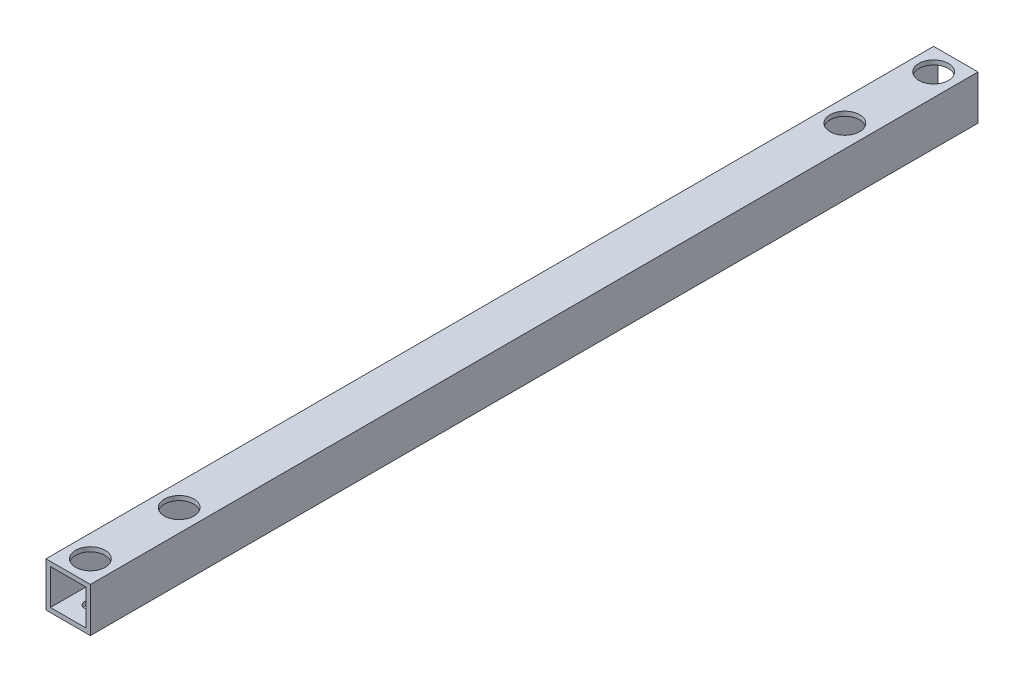
ISO-10303-21;
HEADER;
FILE_DESCRIPTION(('STEP AP214'),'2;1');
FILE_NAME('part.step','',(''),(''),'','','');
FILE_SCHEMA(('AUTOMOTIVE_DESIGN { 1 0 10303 214 1 1 1 1 }'));
ENDSEC;
DATA;
#1=APPLICATION_CONTEXT('core data for automotive mechanical design processes');
#2=APPLICATION_PROTOCOL_DEFINITION('international standard','automotive_design',2000,#1);
#3=PRODUCT_CONTEXT('',#1,'mechanical');
#4=PRODUCT('Part','Part','',(#3));
#5=PRODUCT_RELATED_PRODUCT_CATEGORY('part','',(#4));
#6=PRODUCT_DEFINITION_FORMATION('','',#4);
#7=PRODUCT_DEFINITION_CONTEXT('part definition',#1,'design');
#8=PRODUCT_DEFINITION('design','',#6,#7);
#9=PRODUCT_DEFINITION_SHAPE('','',#8);
#10=(LENGTH_UNIT() NAMED_UNIT(*) SI_UNIT(.MILLI.,.METRE.));
#11=(NAMED_UNIT(*) PLANE_ANGLE_UNIT() SI_UNIT($,.RADIAN.));
#12=(NAMED_UNIT(*) SI_UNIT($,.STERADIAN.) SOLID_ANGLE_UNIT());
#13=UNCERTAINTY_MEASURE_WITH_UNIT(LENGTH_MEASURE(1.E-05),#10,'distance_accuracy_value','');
#14=(GEOMETRIC_REPRESENTATION_CONTEXT(3) GLOBAL_UNCERTAINTY_ASSIGNED_CONTEXT((#13)) GLOBAL_UNIT_ASSIGNED_CONTEXT((#10,
#11,#12)) REPRESENTATION_CONTEXT('',''));
#15=CARTESIAN_POINT('',(0.,0.,0.));
#16=DIRECTION('',(0.,0.,1.));
#17=DIRECTION('',(1.,0.,0.));
#18=AXIS2_PLACEMENT_3D('',#15,#16,#17);
#19=CARTESIAN_POINT('',(0.,0.,300.));
#20=DIRECTION('',(0.,0.,-1.));
#21=DIRECTION('',(-1.,0.,0.));
#22=AXIS2_PLACEMENT_3D('',#19,#20,#21);
#23=PLANE('',#22);
#24=DIRECTION('',(0.,1.,0.));
#25=VECTOR('',#24,1.);
#26=CARTESIAN_POINT('',(7.5,-7.5,300.));
#27=LINE('',#26,#25);
#28=CARTESIAN_POINT('',(7.5,-7.5,300.));
#29=VERTEX_POINT('',#28);
#30=CARTESIAN_POINT('',(7.5,7.5,300.));
#31=VERTEX_POINT('',#30);
#32=EDGE_CURVE('E144',#29,#31,#27,.T.);
#33=ORIENTED_EDGE('',*,*,#32,.T.);
#34=DIRECTION('',(-1.,0.,0.));
#35=VECTOR('',#34,1.);
#36=CARTESIAN_POINT('',(-7.5,7.5,300.));
#37=LINE('',#36,#35);
#38=CARTESIAN_POINT('',(-7.5,7.5,300.));
#39=VERTEX_POINT('',#38);
#40=EDGE_CURVE('E147',#31,#39,#37,.T.);
#41=ORIENTED_EDGE('',*,*,#40,.T.);
#42=DIRECTION('',(0.,-1.,0.));
#43=VECTOR('',#42,1.);
#44=CARTESIAN_POINT('',(-7.5,-7.5,300.));
#45=LINE('',#44,#43);
#46=CARTESIAN_POINT('',(-7.5,-7.5,300.));
#47=VERTEX_POINT('',#46);
#48=EDGE_CURVE('E150',#39,#47,#45,.T.);
#49=ORIENTED_EDGE('',*,*,#48,.T.);
#50=DIRECTION('',(1.,0.,0.));
#51=VECTOR('',#50,1.);
#52=CARTESIAN_POINT('',(-7.5,-7.5,300.));
#53=LINE('',#52,#51);
#54=EDGE_CURVE('E152',#47,#29,#53,.T.);
#55=ORIENTED_EDGE('',*,*,#54,.T.);
#56=EDGE_LOOP('',(#33,#41,#49,#55));
#57=FACE_BOUND('',#56,.T.);
#58=DIRECTION('',(0.,1.,0.));
#59=VECTOR('',#58,1.);
#60=CARTESIAN_POINT('',(6.,-6.,300.));
#61=LINE('',#60,#59);
#62=CARTESIAN_POINT('',(6.,-6.,300.));
#63=VERTEX_POINT('',#62);
#64=CARTESIAN_POINT('',(6.,6.,300.));
#65=VERTEX_POINT('',#64);
#66=EDGE_CURVE('E106',#63,#65,#61,.T.);
#67=ORIENTED_EDGE('',*,*,#66,.F.);
#68=DIRECTION('',(1.,0.,0.));
#69=VECTOR('',#68,1.);
#70=CARTESIAN_POINT('',(-6.,-6.,300.));
#71=LINE('',#70,#69);
#72=CARTESIAN_POINT('',(-6.,-6.,300.));
#73=VERTEX_POINT('',#72);
#74=EDGE_CURVE('E128',#73,#63,#71,.T.);
#75=ORIENTED_EDGE('',*,*,#74,.F.);
#76=DIRECTION('',(0.,-1.,0.));
#77=VECTOR('',#76,1.);
#78=CARTESIAN_POINT('',(-6.,-6.,300.));
#79=LINE('',#78,#77);
#80=CARTESIAN_POINT('',(-6.,6.,300.));
#81=VERTEX_POINT('',#80);
#82=EDGE_CURVE('E126',#81,#73,#79,.T.);
#83=ORIENTED_EDGE('',*,*,#82,.F.);
#84=DIRECTION('',(-1.,0.,0.));
#85=VECTOR('',#84,1.);
#86=CARTESIAN_POINT('',(-6.,6.,300.));
#87=LINE('',#86,#85);
#88=EDGE_CURVE('E114',#65,#81,#87,.T.);
#89=ORIENTED_EDGE('',*,*,#88,.F.);
#90=EDGE_LOOP('',(#67,#75,#83,#89));
#91=FACE_BOUND('',#90,.T.);
#92=ADVANCED_FACE('F39',(#57,#91),#23,.F.);
#93=CARTESIAN_POINT('',(0.,0.,0.));
#94=DIRECTION('',(0.,0.,-1.));
#95=DIRECTION('',(-1.,0.,0.));
#96=AXIS2_PLACEMENT_3D('',#93,#94,#95);
#97=PLANE('',#96);
#98=DIRECTION('',(0.,1.,0.));
#99=VECTOR('',#98,1.);
#100=CARTESIAN_POINT('',(7.5,-7.5,0.));
#101=LINE('',#100,#99);
#102=CARTESIAN_POINT('',(7.5,-7.5,0.));
#103=VERTEX_POINT('',#102);
#104=CARTESIAN_POINT('',(7.5,7.5,0.));
#105=VERTEX_POINT('',#104);
#106=EDGE_CURVE('E122',#103,#105,#101,.T.);
#107=ORIENTED_EDGE('',*,*,#106,.F.);
#108=DIRECTION('',(1.,0.,0.));
#109=VECTOR('',#108,1.);
#110=CARTESIAN_POINT('',(-7.5,-7.5,0.));
#111=LINE('',#110,#109);
#112=CARTESIAN_POINT('',(-7.5,-7.5,0.));
#113=VERTEX_POINT('',#112);
#114=EDGE_CURVE('E148',#113,#103,#111,.T.);
#115=ORIENTED_EDGE('',*,*,#114,.F.);
#116=DIRECTION('',(0.,-1.,0.));
#117=VECTOR('',#116,1.);
#118=CARTESIAN_POINT('',(-7.5,-7.5,0.));
#119=LINE('',#118,#117);
#120=CARTESIAN_POINT('',(-7.5,7.5,0.));
#121=VERTEX_POINT('',#120);
#122=EDGE_CURVE('E159',#121,#113,#119,.T.);
#123=ORIENTED_EDGE('',*,*,#122,.F.);
#124=DIRECTION('',(-1.,0.,0.));
#125=VECTOR('',#124,1.);
#126=CARTESIAN_POINT('',(-7.5,7.5,0.));
#127=LINE('',#126,#125);
#128=EDGE_CURVE('E157',#105,#121,#127,.T.);
#129=ORIENTED_EDGE('',*,*,#128,.F.);
#130=EDGE_LOOP('',(#107,#115,#123,#129));
#131=FACE_BOUND('',#130,.T.);
#132=DIRECTION('',(1.,0.,0.));
#133=VECTOR('',#132,1.);
#134=CARTESIAN_POINT('',(-6.,-6.,0.));
#135=LINE('',#134,#133);
#136=CARTESIAN_POINT('',(-6.,-6.,0.));
#137=VERTEX_POINT('',#136);
#138=CARTESIAN_POINT('',(6.,-6.,0.));
#139=VERTEX_POINT('',#138);
#140=EDGE_CURVE('E115',#137,#139,#135,.T.);
#141=ORIENTED_EDGE('',*,*,#140,.T.);
#142=DIRECTION('',(0.,1.,0.));
#143=VECTOR('',#142,1.);
#144=CARTESIAN_POINT('',(6.,-6.,0.));
#145=LINE('',#144,#143);
#146=CARTESIAN_POINT('',(6.,6.,0.));
#147=VERTEX_POINT('',#146);
#148=EDGE_CURVE('E64',#139,#147,#145,.T.);
#149=ORIENTED_EDGE('',*,*,#148,.T.);
#150=DIRECTION('',(-1.,0.,0.));
#151=VECTOR('',#150,1.);
#152=CARTESIAN_POINT('',(-6.,6.,0.));
#153=LINE('',#152,#151);
#154=CARTESIAN_POINT('',(-6.,6.,0.));
#155=VERTEX_POINT('',#154);
#156=EDGE_CURVE('E121',#147,#155,#153,.T.);
#157=ORIENTED_EDGE('',*,*,#156,.T.);
#158=DIRECTION('',(0.,-1.,0.));
#159=VECTOR('',#158,1.);
#160=CARTESIAN_POINT('',(-6.,-6.,0.));
#161=LINE('',#160,#159);
#162=EDGE_CURVE('E136',#155,#137,#161,.T.);
#163=ORIENTED_EDGE('',*,*,#162,.T.);
#164=EDGE_LOOP('',(#141,#149,#157,#163));
#165=FACE_BOUND('',#164,.T.);
#166=ADVANCED_FACE('F229',(#131,#165),#97,.T.);
#167=CARTESIAN_POINT('',(7.5,-7.5,300.));
#168=DIRECTION('',(-1.,0.,0.));
#169=DIRECTION('',(0.,0.,1.));
#170=AXIS2_PLACEMENT_3D('',#167,#168,#169);
#171=PLANE('',#170);
#172=ORIENTED_EDGE('',*,*,#106,.T.);
#173=DIRECTION('',(0.,0.,-1.));
#174=VECTOR('',#173,1.);
#175=CARTESIAN_POINT('',(7.5,7.5,300.));
#176=LINE('',#175,#174);
#177=EDGE_CURVE('E11',#31,#105,#176,.T.);
#178=ORIENTED_EDGE('',*,*,#177,.F.);
#179=ORIENTED_EDGE('',*,*,#32,.F.);
#180=DIRECTION('',(0.,0.,-1.));
#181=VECTOR('',#180,1.);
#182=CARTESIAN_POINT('',(7.5,-7.5,300.));
#183=LINE('',#182,#181);
#184=EDGE_CURVE('E154',#29,#103,#183,.T.);
#185=ORIENTED_EDGE('',*,*,#184,.T.);
#186=EDGE_LOOP('',(#172,#178,#179,#185));
#187=FACE_BOUND('',#186,.T.);
#188=ADVANCED_FACE('F41',(#187),#171,.F.);
#189=CARTESIAN_POINT('',(-7.5,7.5,300.));
#190=DIRECTION('',(0.,-1.,0.));
#191=DIRECTION('',(0.,0.,-1.));
#192=AXIS2_PLACEMENT_3D('',#189,#190,#191);
#193=PLANE('',#192);
#194=CARTESIAN_POINT('',(-8.50054585898909E-13,7.5,292.5));
#195=DIRECTION('',(0.,1.,0.));
#196=DIRECTION('',(0.,0.,1.));
#197=AXIS2_PLACEMENT_3D('',#194,#195,#196);
#198=CIRCLE('',#197,5.);
#199=CARTESIAN_POINT('',(-8.50054585898909E-13,7.5,297.5));
#200=VERTEX_POINT('',#199);
#201=EDGE_CURVE('E185',#200,#200,#198,.T.);
#202=ORIENTED_EDGE('',*,*,#201,.F.);
#203=EDGE_LOOP('',(#202));
#204=FACE_BOUND('',#203,.T.);
#205=CARTESIAN_POINT('',(-8.74713494715871E-13,7.5,262.5));
#206=DIRECTION('',(0.,1.,0.));
#207=DIRECTION('',(0.,0.,1.));
#208=AXIS2_PLACEMENT_3D('',#205,#206,#207);
#209=CIRCLE('',#208,5.);
#210=CARTESIAN_POINT('',(-8.74713494715871E-13,7.5,267.5));
#211=VERTEX_POINT('',#210);
#212=EDGE_CURVE('E297',#211,#211,#209,.T.);
#213=ORIENTED_EDGE('',*,*,#212,.F.);
#214=EDGE_LOOP('',(#213));
#215=FACE_BOUND('',#214,.T.);
#216=CARTESIAN_POINT('',(0.,7.5,37.5));
#217=DIRECTION('',(0.,1.,0.));
#218=DIRECTION('',(0.,0.,1.));
#219=AXIS2_PLACEMENT_3D('',#216,#217,#218);
#220=CIRCLE('',#219,5.);
#221=CARTESIAN_POINT('',(0.,7.5,42.5));
#222=VERTEX_POINT('',#221);
#223=EDGE_CURVE('E300',#222,#222,#220,.T.);
#224=ORIENTED_EDGE('',*,*,#223,.F.);
#225=EDGE_LOOP('',(#224));
#226=FACE_BOUND('',#225,.T.);
#227=CARTESIAN_POINT('',(0.,7.5,7.5));
#228=DIRECTION('',(0.,1.,0.));
#229=DIRECTION('',(0.,0.,1.));
#230=AXIS2_PLACEMENT_3D('',#227,#228,#229);
#231=CIRCLE('',#230,5.);
#232=CARTESIAN_POINT('',(0.,7.5,12.5));
#233=VERTEX_POINT('',#232);
#234=EDGE_CURVE('E205',#233,#233,#231,.T.);
#235=ORIENTED_EDGE('',*,*,#234,.F.);
#236=EDGE_LOOP('',(#235));
#237=FACE_BOUND('',#236,.T.);
#238=ORIENTED_EDGE('',*,*,#128,.T.);
#239=DIRECTION('',(0.,0.,-1.));
#240=VECTOR('',#239,1.);
#241=CARTESIAN_POINT('',(-7.5,7.5,300.));
#242=LINE('',#241,#240);
#243=EDGE_CURVE('E48',#39,#121,#242,.T.);
#244=ORIENTED_EDGE('',*,*,#243,.F.);
#245=ORIENTED_EDGE('',*,*,#40,.F.);
#246=ORIENTED_EDGE('',*,*,#177,.T.);
#247=EDGE_LOOP('',(#238,#244,#245,#246));
#248=FACE_BOUND('',#247,.T.);
#249=ADVANCED_FACE('F233',(#204,#215,#226,#237,#248),#193,.F.);
#250=CARTESIAN_POINT('',(-7.5,-7.5,300.));
#251=DIRECTION('',(1.,0.,0.));
#252=DIRECTION('',(0.,0.,-1.));
#253=AXIS2_PLACEMENT_3D('',#250,#251,#252);
#254=PLANE('',#253);
#255=ORIENTED_EDGE('',*,*,#122,.T.);
#256=DIRECTION('',(0.,0.,-1.));
#257=VECTOR('',#256,1.);
#258=CARTESIAN_POINT('',(-7.5,-7.5,300.));
#259=LINE('',#258,#257);
#260=EDGE_CURVE('E164',#47,#113,#259,.T.);
#261=ORIENTED_EDGE('',*,*,#260,.F.);
#262=ORIENTED_EDGE('',*,*,#48,.F.);
#263=ORIENTED_EDGE('',*,*,#243,.T.);
#264=EDGE_LOOP('',(#255,#261,#262,#263));
#265=FACE_BOUND('',#264,.T.);
#266=ADVANCED_FACE('F216',(#265),#254,.F.);
#267=CARTESIAN_POINT('',(-7.5,-7.5,300.));
#268=DIRECTION('',(0.,1.,0.));
#269=DIRECTION('',(0.,0.,1.));
#270=AXIS2_PLACEMENT_3D('',#267,#268,#269);
#271=PLANE('',#270);
#272=CARTESIAN_POINT('',(0.,-7.5,7.5));
#273=DIRECTION('',(0.,-1.,0.));
#274=DIRECTION('',(0.,0.,-1.));
#275=AXIS2_PLACEMENT_3D('',#272,#273,#274);
#276=CIRCLE('',#275,2.);
#277=CARTESIAN_POINT('',(0.,-7.5,5.5));
#278=VERTEX_POINT('',#277);
#279=EDGE_CURVE('E201',#278,#278,#276,.T.);
#280=ORIENTED_EDGE('',*,*,#279,.F.);
#281=EDGE_LOOP('',(#280));
#282=FACE_BOUND('',#281,.T.);
#283=CARTESIAN_POINT('',(-8.50054585898909E-13,-7.5,292.5));
#284=DIRECTION('',(0.,-1.,0.));
#285=DIRECTION('',(0.,0.,-1.));
#286=AXIS2_PLACEMENT_3D('',#283,#284,#285);
#287=CIRCLE('',#286,2.);
#288=CARTESIAN_POINT('',(-8.50054585898909E-13,-7.5,290.5));
#289=VERTEX_POINT('',#288);
#290=EDGE_CURVE('E196',#289,#289,#287,.T.);
#291=ORIENTED_EDGE('',*,*,#290,.F.);
#292=EDGE_LOOP('',(#291));
#293=FACE_BOUND('',#292,.T.);
#294=CARTESIAN_POINT('',(-8.74713494715871E-13,-7.5,262.5));
#295=DIRECTION('',(0.,-1.,0.));
#296=DIRECTION('',(0.,0.,-1.));
#297=AXIS2_PLACEMENT_3D('',#294,#295,#296);
#298=CIRCLE('',#297,2.);
#299=CARTESIAN_POINT('',(-8.74713494715871E-13,-7.5,260.5));
#300=VERTEX_POINT('',#299);
#301=EDGE_CURVE('E192',#300,#300,#298,.T.);
#302=ORIENTED_EDGE('',*,*,#301,.F.);
#303=EDGE_LOOP('',(#302));
#304=FACE_BOUND('',#303,.T.);
#305=CARTESIAN_POINT('',(0.,-7.5,37.5));
#306=DIRECTION('',(0.,-1.,0.));
#307=DIRECTION('',(0.,0.,-1.));
#308=AXIS2_PLACEMENT_3D('',#305,#306,#307);
#309=CIRCLE('',#308,2.);
#310=CARTESIAN_POINT('',(0.,-7.5,35.5));
#311=VERTEX_POINT('',#310);
#312=EDGE_CURVE('E173',#311,#311,#309,.T.);
#313=ORIENTED_EDGE('',*,*,#312,.F.);
#314=EDGE_LOOP('',(#313));
#315=FACE_BOUND('',#314,.T.);
#316=ORIENTED_EDGE('',*,*,#114,.T.);
#317=ORIENTED_EDGE('',*,*,#184,.F.);
#318=ORIENTED_EDGE('',*,*,#54,.F.);
#319=ORIENTED_EDGE('',*,*,#260,.T.);
#320=EDGE_LOOP('',(#316,#317,#318,#319));
#321=FACE_BOUND('',#320,.T.);
#322=ADVANCED_FACE('F213',(#282,#293,#304,#315,#321),#271,.F.);
#323=CARTESIAN_POINT('',(6.,-6.,300.));
#324=DIRECTION('',(-1.,0.,0.));
#325=DIRECTION('',(0.,0.,1.));
#326=AXIS2_PLACEMENT_3D('',#323,#324,#325);
#327=PLANE('',#326);
#328=ORIENTED_EDGE('',*,*,#148,.F.);
#329=DIRECTION('',(0.,0.,-1.));
#330=VECTOR('',#329,1.);
#331=CARTESIAN_POINT('',(6.,-6.,300.));
#332=LINE('',#331,#330);
#333=EDGE_CURVE('E110',#63,#139,#332,.T.);
#334=ORIENTED_EDGE('',*,*,#333,.F.);
#335=ORIENTED_EDGE('',*,*,#66,.T.);
#336=DIRECTION('',(0.,0.,-1.));
#337=VECTOR('',#336,1.);
#338=CARTESIAN_POINT('',(6.,6.,300.));
#339=LINE('',#338,#337);
#340=EDGE_CURVE('E109',#65,#147,#339,.T.);
#341=ORIENTED_EDGE('',*,*,#340,.T.);
#342=EDGE_LOOP('',(#328,#334,#335,#341));
#343=FACE_BOUND('',#342,.T.);
#344=ADVANCED_FACE('F108',(#343),#327,.T.);
#345=CARTESIAN_POINT('',(-6.,6.,300.));
#346=DIRECTION('',(0.,-1.,0.));
#347=DIRECTION('',(0.,0.,-1.));
#348=AXIS2_PLACEMENT_3D('',#345,#346,#347);
#349=PLANE('',#348);
#350=CARTESIAN_POINT('',(-8.50054585898909E-13,6.,292.5));
#351=DIRECTION('',(0.,-1.,0.));
#352=DIRECTION('',(0.,0.,-1.));
#353=AXIS2_PLACEMENT_3D('',#350,#351,#352);
#354=CIRCLE('',#353,5.);
#355=CARTESIAN_POINT('',(-8.50054585898909E-13,6.,287.5));
#356=VERTEX_POINT('',#355);
#357=EDGE_CURVE('E43',#356,#356,#354,.T.);
#358=ORIENTED_EDGE('',*,*,#357,.F.);
#359=EDGE_LOOP('',(#358));
#360=FACE_BOUND('',#359,.T.);
#361=CARTESIAN_POINT('',(-8.74713494715871E-13,6.,262.5));
#362=DIRECTION('',(0.,-1.,0.));
#363=DIRECTION('',(0.,0.,-1.));
#364=AXIS2_PLACEMENT_3D('',#361,#362,#363);
#365=CIRCLE('',#364,5.);
#366=CARTESIAN_POINT('',(-8.74713494715871E-13,6.,257.5));
#367=VERTEX_POINT('',#366);
#368=EDGE_CURVE('E187',#367,#367,#365,.T.);
#369=ORIENTED_EDGE('',*,*,#368,.F.);
#370=EDGE_LOOP('',(#369));
#371=FACE_BOUND('',#370,.T.);
#372=CARTESIAN_POINT('',(0.,6.,37.5));
#373=DIRECTION('',(0.,-1.,0.));
#374=DIRECTION('',(0.,0.,-1.));
#375=AXIS2_PLACEMENT_3D('',#372,#373,#374);
#376=CIRCLE('',#375,5.);
#377=CARTESIAN_POINT('',(0.,6.,32.5));
#378=VERTEX_POINT('',#377);
#379=EDGE_CURVE('E184',#378,#378,#376,.T.);
#380=ORIENTED_EDGE('',*,*,#379,.F.);
#381=EDGE_LOOP('',(#380));
#382=FACE_BOUND('',#381,.T.);
#383=CARTESIAN_POINT('',(0.,6.,7.5));
#384=DIRECTION('',(0.,-1.,0.));
#385=DIRECTION('',(0.,0.,-1.));
#386=AXIS2_PLACEMENT_3D('',#383,#384,#385);
#387=CIRCLE('',#386,5.);
#388=CARTESIAN_POINT('',(0.,6.,2.5));
#389=VERTEX_POINT('',#388);
#390=EDGE_CURVE('E181',#389,#389,#387,.T.);
#391=ORIENTED_EDGE('',*,*,#390,.F.);
#392=EDGE_LOOP('',(#391));
#393=FACE_BOUND('',#392,.T.);
#394=ORIENTED_EDGE('',*,*,#156,.F.);
#395=ORIENTED_EDGE('',*,*,#340,.F.);
#396=ORIENTED_EDGE('',*,*,#88,.T.);
#397=DIRECTION('',(0.,0.,-1.));
#398=VECTOR('',#397,1.);
#399=CARTESIAN_POINT('',(-6.,6.,300.));
#400=LINE('',#399,#398);
#401=EDGE_CURVE('E123',#81,#155,#400,.T.);
#402=ORIENTED_EDGE('',*,*,#401,.T.);
#403=EDGE_LOOP('',(#394,#395,#396,#402));
#404=FACE_BOUND('',#403,.T.);
#405=ADVANCED_FACE('F118',(#360,#371,#382,#393,#404),#349,.T.);
#406=CARTESIAN_POINT('',(-6.,-6.,300.));
#407=DIRECTION('',(1.,0.,0.));
#408=DIRECTION('',(0.,0.,-1.));
#409=AXIS2_PLACEMENT_3D('',#406,#407,#408);
#410=PLANE('',#409);
#411=ORIENTED_EDGE('',*,*,#162,.F.);
#412=ORIENTED_EDGE('',*,*,#401,.F.);
#413=ORIENTED_EDGE('',*,*,#82,.T.);
#414=DIRECTION('',(0.,0.,-1.));
#415=VECTOR('',#414,1.);
#416=CARTESIAN_POINT('',(-6.,-6.,300.));
#417=LINE('',#416,#415);
#418=EDGE_CURVE('E56',#73,#137,#417,.T.);
#419=ORIENTED_EDGE('',*,*,#418,.T.);
#420=EDGE_LOOP('',(#411,#412,#413,#419));
#421=FACE_BOUND('',#420,.T.);
#422=ADVANCED_FACE('F255',(#421),#410,.T.);
#423=CARTESIAN_POINT('',(-6.,-6.,300.));
#424=DIRECTION('',(0.,1.,0.));
#425=DIRECTION('',(0.,0.,1.));
#426=AXIS2_PLACEMENT_3D('',#423,#424,#425);
#427=PLANE('',#426);
#428=CARTESIAN_POINT('',(0.,-6.,7.5));
#429=DIRECTION('',(0.,1.,0.));
#430=DIRECTION('',(0.,0.,1.));
#431=AXIS2_PLACEMENT_3D('',#428,#429,#430);
#432=CIRCLE('',#431,2.);
#433=CARTESIAN_POINT('',(0.,-6.,9.5));
#434=VERTEX_POINT('',#433);
#435=EDGE_CURVE('E134',#434,#434,#432,.T.);
#436=ORIENTED_EDGE('',*,*,#435,.F.);
#437=EDGE_LOOP('',(#436));
#438=FACE_BOUND('',#437,.T.);
#439=CARTESIAN_POINT('',(-8.50054585898909E-13,-6.,292.5));
#440=DIRECTION('',(0.,1.,0.));
#441=DIRECTION('',(0.,0.,1.));
#442=AXIS2_PLACEMENT_3D('',#439,#440,#441);
#443=CIRCLE('',#442,2.);
#444=CARTESIAN_POINT('',(-8.50054585898909E-13,-6.,294.5));
#445=VERTEX_POINT('',#444);
#446=EDGE_CURVE('E176',#445,#445,#443,.T.);
#447=ORIENTED_EDGE('',*,*,#446,.F.);
#448=EDGE_LOOP('',(#447));
#449=FACE_BOUND('',#448,.T.);
#450=CARTESIAN_POINT('',(-8.74713494715871E-13,-6.,262.5));
#451=DIRECTION('',(0.,1.,0.));
#452=DIRECTION('',(0.,0.,1.));
#453=AXIS2_PLACEMENT_3D('',#450,#451,#452);
#454=CIRCLE('',#453,2.);
#455=CARTESIAN_POINT('',(-8.74713494715871E-13,-6.,264.5));
#456=VERTEX_POINT('',#455);
#457=EDGE_CURVE('E172',#456,#456,#454,.T.);
#458=ORIENTED_EDGE('',*,*,#457,.F.);
#459=EDGE_LOOP('',(#458));
#460=FACE_BOUND('',#459,.T.);
#461=CARTESIAN_POINT('',(0.,-6.,37.5));
#462=DIRECTION('',(0.,1.,0.));
#463=DIRECTION('',(0.,0.,1.));
#464=AXIS2_PLACEMENT_3D('',#461,#462,#463);
#465=CIRCLE('',#464,2.);
#466=CARTESIAN_POINT('',(0.,-6.,39.5));
#467=VERTEX_POINT('',#466);
#468=EDGE_CURVE('E169',#467,#467,#465,.T.);
#469=ORIENTED_EDGE('',*,*,#468,.F.);
#470=EDGE_LOOP('',(#469));
#471=FACE_BOUND('',#470,.T.);
#472=ORIENTED_EDGE('',*,*,#140,.F.);
#473=ORIENTED_EDGE('',*,*,#418,.F.);
#474=ORIENTED_EDGE('',*,*,#74,.T.);
#475=ORIENTED_EDGE('',*,*,#333,.T.);
#476=EDGE_LOOP('',(#472,#473,#474,#475));
#477=FACE_BOUND('',#476,.T.);
#478=ADVANCED_FACE('F259',(#438,#449,#460,#471,#477),#427,.T.);
#479=CARTESIAN_POINT('',(0.,12.5,37.5));
#480=DIRECTION('',(0.,-1.,0.));
#481=DIRECTION('',(0.,0.,-1.));
#482=AXIS2_PLACEMENT_3D('',#479,#480,#481);
#483=CYLINDRICAL_SURFACE('',#482,2.);
#484=ORIENTED_EDGE('',*,*,#468,.T.);
#485=EDGE_LOOP('',(#484));
#486=FACE_BOUND('',#485,.T.);
#487=ORIENTED_EDGE('',*,*,#312,.T.);
#488=EDGE_LOOP('',(#487));
#489=FACE_BOUND('',#488,.T.);
#490=ADVANCED_FACE('F211',(#486,#489),#483,.F.);
#491=CARTESIAN_POINT('',(-8.74713494715871E-13,12.5,262.5));
#492=DIRECTION('',(0.,-1.,0.));
#493=DIRECTION('',(0.,0.,-1.));
#494=AXIS2_PLACEMENT_3D('',#491,#492,#493);
#495=CYLINDRICAL_SURFACE('',#494,2.);
#496=ORIENTED_EDGE('',*,*,#457,.T.);
#497=EDGE_LOOP('',(#496));
#498=FACE_BOUND('',#497,.T.);
#499=ORIENTED_EDGE('',*,*,#301,.T.);
#500=EDGE_LOOP('',(#499));
#501=FACE_BOUND('',#500,.T.);
#502=ADVANCED_FACE('F266',(#498,#501),#495,.F.);
#503=CARTESIAN_POINT('',(-8.50054585898909E-13,12.5,292.5));
#504=DIRECTION('',(0.,-1.,0.));
#505=DIRECTION('',(0.,0.,-1.));
#506=AXIS2_PLACEMENT_3D('',#503,#504,#505);
#507=CYLINDRICAL_SURFACE('',#506,2.);
#508=ORIENTED_EDGE('',*,*,#446,.T.);
#509=EDGE_LOOP('',(#508));
#510=FACE_BOUND('',#509,.T.);
#511=ORIENTED_EDGE('',*,*,#290,.T.);
#512=EDGE_LOOP('',(#511));
#513=FACE_BOUND('',#512,.T.);
#514=ADVANCED_FACE('F268',(#510,#513),#507,.F.);
#515=CARTESIAN_POINT('',(0.,12.5,7.5));
#516=DIRECTION('',(0.,-1.,0.));
#517=DIRECTION('',(0.,0.,-1.));
#518=AXIS2_PLACEMENT_3D('',#515,#516,#517);
#519=CYLINDRICAL_SURFACE('',#518,2.);
#520=ORIENTED_EDGE('',*,*,#435,.T.);
#521=EDGE_LOOP('',(#520));
#522=FACE_BOUND('',#521,.T.);
#523=ORIENTED_EDGE('',*,*,#279,.T.);
#524=EDGE_LOOP('',(#523));
#525=FACE_BOUND('',#524,.T.);
#526=ADVANCED_FACE('F271',(#522,#525),#519,.F.);
#527=CARTESIAN_POINT('',(0.,-2.5,7.5));
#528=DIRECTION('',(0.,1.,0.));
#529=DIRECTION('',(0.,0.,1.));
#530=AXIS2_PLACEMENT_3D('',#527,#528,#529);
#531=CYLINDRICAL_SURFACE('',#530,5.);
#532=ORIENTED_EDGE('',*,*,#390,.T.);
#533=EDGE_LOOP('',(#532));
#534=FACE_BOUND('',#533,.T.);
#535=ORIENTED_EDGE('',*,*,#234,.T.);
#536=EDGE_LOOP('',(#535));
#537=FACE_BOUND('',#536,.T.);
#538=ADVANCED_FACE('F275',(#534,#537),#531,.F.);
#539=CARTESIAN_POINT('',(0.,-2.5,37.5));
#540=DIRECTION('',(0.,1.,0.));
#541=DIRECTION('',(0.,0.,1.));
#542=AXIS2_PLACEMENT_3D('',#539,#540,#541);
#543=CYLINDRICAL_SURFACE('',#542,5.);
#544=ORIENTED_EDGE('',*,*,#379,.T.);
#545=EDGE_LOOP('',(#544));
#546=FACE_BOUND('',#545,.T.);
#547=ORIENTED_EDGE('',*,*,#223,.T.);
#548=EDGE_LOOP('',(#547));
#549=FACE_BOUND('',#548,.T.);
#550=ADVANCED_FACE('F282',(#546,#549),#543,.F.);
#551=CARTESIAN_POINT('',(-8.74713494715871E-13,-2.5,262.5));
#552=DIRECTION('',(0.,1.,0.));
#553=DIRECTION('',(0.,0.,1.));
#554=AXIS2_PLACEMENT_3D('',#551,#552,#553);
#555=CYLINDRICAL_SURFACE('',#554,5.);
#556=ORIENTED_EDGE('',*,*,#368,.T.);
#557=EDGE_LOOP('',(#556));
#558=FACE_BOUND('',#557,.T.);
#559=ORIENTED_EDGE('',*,*,#212,.T.);
#560=EDGE_LOOP('',(#559));
#561=FACE_BOUND('',#560,.T.);
#562=ADVANCED_FACE('F286',(#558,#561),#555,.F.);
#563=CARTESIAN_POINT('',(-8.50054585898909E-13,-2.5,292.5));
#564=DIRECTION('',(0.,1.,0.));
#565=DIRECTION('',(0.,0.,1.));
#566=AXIS2_PLACEMENT_3D('',#563,#564,#565);
#567=CYLINDRICAL_SURFACE('',#566,5.);
#568=ORIENTED_EDGE('',*,*,#357,.T.);
#569=EDGE_LOOP('',(#568));
#570=FACE_BOUND('',#569,.T.);
#571=ORIENTED_EDGE('',*,*,#201,.T.);
#572=EDGE_LOOP('',(#571));
#573=FACE_BOUND('',#572,.T.);
#574=ADVANCED_FACE('F290',(#570,#573),#567,.F.);
#575=CLOSED_SHELL('',(#92,#166,#188,#249,#266,#322,#344,#405,#422,#478,#490,#502,#514,#526,#538,
#550,#562,#574));
#576=MANIFOLD_SOLID_BREP('B2',#575);
#577=ADVANCED_BREP_SHAPE_REPRESENTATION('',(#18,#576),#14);
#578=SHAPE_DEFINITION_REPRESENTATION(#9,#577);
ENDSEC;
END-ISO-10303-21;
